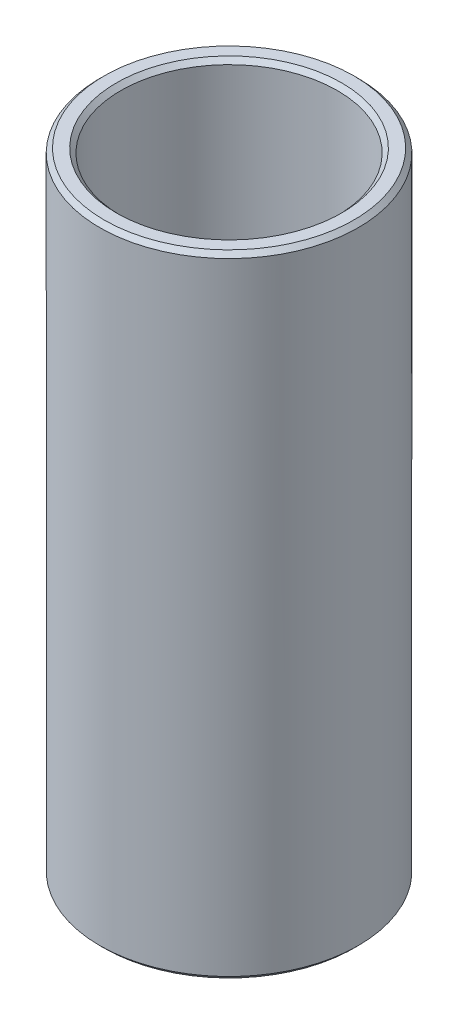
ISO-10303-21;
HEADER;
FILE_DESCRIPTION(('STEP AP214'),'2;1');
FILE_NAME('part.step','',(''),(''),'','','');
FILE_SCHEMA(('AUTOMOTIVE_DESIGN { 1 0 10303 214 1 1 1 1 }'));
ENDSEC;
DATA;
#1=APPLICATION_CONTEXT('core data for automotive mechanical design processes');
#2=APPLICATION_PROTOCOL_DEFINITION('international standard','automotive_design',2000,#1);
#3=PRODUCT_CONTEXT('',#1,'mechanical');
#4=PRODUCT('Part','Part','',(#3));
#5=PRODUCT_RELATED_PRODUCT_CATEGORY('part','',(#4));
#6=PRODUCT_DEFINITION_FORMATION('','',#4);
#7=PRODUCT_DEFINITION_CONTEXT('part definition',#1,'design');
#8=PRODUCT_DEFINITION('design','',#6,#7);
#9=PRODUCT_DEFINITION_SHAPE('','',#8);
#10=(LENGTH_UNIT() NAMED_UNIT(*) SI_UNIT(.MILLI.,.METRE.));
#11=(NAMED_UNIT(*) PLANE_ANGLE_UNIT() SI_UNIT($,.RADIAN.));
#12=(NAMED_UNIT(*) SI_UNIT($,.STERADIAN.) SOLID_ANGLE_UNIT());
#13=UNCERTAINTY_MEASURE_WITH_UNIT(LENGTH_MEASURE(1.E-05),#10,'distance_accuracy_value','');
#14=(GEOMETRIC_REPRESENTATION_CONTEXT(3) GLOBAL_UNCERTAINTY_ASSIGNED_CONTEXT((#13)) GLOBAL_UNIT_ASSIGNED_CONTEXT((#10,
#11,#12)) REPRESENTATION_CONTEXT('',''));
#15=CARTESIAN_POINT('',(0.,0.,0.));
#16=DIRECTION('',(0.,0.,1.));
#17=DIRECTION('',(1.,0.,0.));
#18=AXIS2_PLACEMENT_3D('',#15,#16,#17);
#19=CARTESIAN_POINT('',(0.,231.668085066269,0.));
#20=DIRECTION('',(0.,-1.,0.));
#21=DIRECTION('',(0.,0.,-1.));
#22=AXIS2_PLACEMENT_3D('',#19,#20,#21);
#23=CYLINDRICAL_SURFACE('',#22,47.5);
#24=CARTESIAN_POINT('',(0.,1.62430322652468,0.));
#25=DIRECTION('',(0.,1.,0.));
#26=DIRECTION('',(0.,0.,1.));
#27=AXIS2_PLACEMENT_3D('',#24,#25,#26);
#28=CIRCLE('',#27,47.5);
#29=CARTESIAN_POINT('',(0.,1.62430322652468,-47.5));
#30=VERTEX_POINT('',#29);
#31=EDGE_CURVE('E10',#30,#30,#28,.T.);
#32=CARTESIAN_POINT('',(0.,230.043781839745,0.));
#33=DIRECTION('',(0.,1.,0.));
#34=DIRECTION('',(0.,0.,1.));
#35=AXIS2_PLACEMENT_3D('',#32,#33,#34);
#36=CIRCLE('',#35,47.5);
#37=CARTESIAN_POINT('',(0.,230.043781839745,-47.5));
#38=VERTEX_POINT('',#37);
#39=EDGE_CURVE('E50',#38,#38,#36,.F.);
#40=CARTESIAN_POINT('',(0.,1.62430322652468,-47.5));
#41=CARTESIAN_POINT('',(0.,4.00367279541238,-47.5));
#42=CARTESIAN_POINT('',(0.,6.3830423643001,-47.5));
#43=CARTESIAN_POINT('',(0.,11.1417815020755,-47.5));
#44=CARTESIAN_POINT('',(0.,13.5211510709632,-47.5));
#45=CARTESIAN_POINT('',(0.,18.2798902087386,-47.5));
#46=CARTESIAN_POINT('',(0.,20.6592597776264,-47.5));
#47=CARTESIAN_POINT('',(0.,25.4179989154018,-47.5));
#48=CARTESIAN_POINT('',(0.,27.7973684842895,-47.5));
#49=CARTESIAN_POINT('',(0.,32.5561076220649,-47.5));
#50=CARTESIAN_POINT('',(0.,34.9354771909526,-47.5));
#51=CARTESIAN_POINT('',(0.,39.694216328728,-47.5));
#52=CARTESIAN_POINT('',(0.,42.0735858976158,-47.5));
#53=CARTESIAN_POINT('',(0.,46.8323250353912,-47.5));
#54=CARTESIAN_POINT('',(0.,49.2116946042789,-47.5));
#55=CARTESIAN_POINT('',(0.,53.9704337420543,-47.5));
#56=CARTESIAN_POINT('',(0.,56.349803310942,-47.5));
#57=CARTESIAN_POINT('',(0.,61.1085424487174,-47.5));
#58=CARTESIAN_POINT('',(0.,63.4879120176051,-47.5));
#59=CARTESIAN_POINT('',(0.,68.2466511553805,-47.5));
#60=CARTESIAN_POINT('',(0.,70.6260207242682,-47.5));
#61=CARTESIAN_POINT('',(0.,75.3847598620437,-47.5));
#62=CARTESIAN_POINT('',(0.,77.7641294309314,-47.5));
#63=CARTESIAN_POINT('',(0.,82.5228685687068,-47.5));
#64=CARTESIAN_POINT('',(0.,84.9022381375945,-47.5));
#65=CARTESIAN_POINT('',(0.,89.6609772753699,-47.5));
#66=CARTESIAN_POINT('',(0.,92.0403468442576,-47.5));
#67=CARTESIAN_POINT('',(0.,96.7990859820331,-47.5));
#68=CARTESIAN_POINT('',(0.,99.1784555509208,-47.5));
#69=CARTESIAN_POINT('',(0.,103.937194688696,-47.5));
#70=CARTESIAN_POINT('',(0.,106.316564257584,-47.5));
#71=CARTESIAN_POINT('',(0.,111.075303395359,-47.5));
#72=CARTESIAN_POINT('',(0.,113.454672964247,-47.5));
#73=CARTESIAN_POINT('',(0.,118.213412102022,-47.5));
#74=CARTESIAN_POINT('',(0.,120.59278167091,-47.5));
#75=CARTESIAN_POINT('',(0.,125.351520808686,-47.5));
#76=CARTESIAN_POINT('',(0.,127.730890377573,-47.5));
#77=CARTESIAN_POINT('',(0.,132.489629515349,-47.5));
#78=CARTESIAN_POINT('',(0.,134.868999084236,-47.5));
#79=CARTESIAN_POINT('',(0.,139.627738222012,-47.5));
#80=CARTESIAN_POINT('',(0.,142.0071077909,-47.5));
#81=CARTESIAN_POINT('',(0.,146.765846928675,-47.5));
#82=CARTESIAN_POINT('',(0.,149.145216497563,-47.5));
#83=CARTESIAN_POINT('',(0.,153.903955635338,-47.5));
#84=CARTESIAN_POINT('',(0.,156.283325204226,-47.5));
#85=CARTESIAN_POINT('',(0.,161.042064342001,-47.5));
#86=CARTESIAN_POINT('',(0.,163.421433910889,-47.5));
#87=CARTESIAN_POINT('',(0.,168.180173048664,-47.5));
#88=CARTESIAN_POINT('',(0.,170.559542617552,-47.5));
#89=CARTESIAN_POINT('',(0.,175.318281755327,-47.5));
#90=CARTESIAN_POINT('',(0.,177.697651324215,-47.5));
#91=CARTESIAN_POINT('',(0.,182.456390461991,-47.5));
#92=CARTESIAN_POINT('',(0.,184.835760030878,-47.5));
#93=CARTESIAN_POINT('',(0.,189.594499168654,-47.5));
#94=CARTESIAN_POINT('',(0.,191.973868737541,-47.5));
#95=CARTESIAN_POINT('',(0.,196.732607875317,-47.5));
#96=CARTESIAN_POINT('',(0.,199.111977444205,-47.5));
#97=CARTESIAN_POINT('',(0.,203.87071658198,-47.5));
#98=CARTESIAN_POINT('',(0.,206.250086150868,-47.5));
#99=CARTESIAN_POINT('',(0.,211.008825288643,-47.5));
#100=CARTESIAN_POINT('',(0.,213.388194857531,-47.5));
#101=CARTESIAN_POINT('',(0.,218.146933995306,-47.5));
#102=CARTESIAN_POINT('',(0.,220.526303564194,-47.5));
#103=CARTESIAN_POINT('',(0.,225.285042701969,-47.5));
#104=CARTESIAN_POINT('',(0.,227.664412270857,-47.5));
#105=CARTESIAN_POINT('',(0.,230.043781839745,-47.5));
#106=B_SPLINE_CURVE_WITH_KNOTS('',3,(#40,#41,#42,#43,#44,#45,#46,#47,#48,#49,#50,#51,#52,#53,
#54,#55,#56,#57,#58,#59,#60,#61,#62,#63,#64,#65,#66,#67,#68,#69,#70,#71,#72,#73,#74,#75,#76,#77,
#78,#79,#80,#81,#82,#83,#84,#85,#86,#87,#88,#89,#90,#91,#92,#93,#94,#95,#96,#97,#98,#99,#100,
#101,#102,#103,#104,#105),.UNSPECIFIED.,.F.,.F.,(4,2,2,2,2,2,2,2,2,2,2,2,2,2,2,2,2,2,2,2,2,2,2,
2,2,2,2,2,2,2,2,2,4),(0.,7.13810870666312,14.2762174133262,21.4143261199894,28.5524348266525,
35.6905435333156,42.8286522399788,49.9667609466419,57.104869653305,64.2429783599681,
71.3810870666313,78.5191957732944,85.6573044799575,92.7954131866207,99.9335218932838,
107.071630599947,114.20973930661,121.347848013273,128.485956719936,135.624065426599,
142.762174133263,149.900282839926,157.038391546589,164.176500253252,171.314608959915,
178.452717666578,185.590826373241,192.728935079904,199.867043786568,207.005152493231,
214.143261199894,221.281369906557,228.41947861322),.UNSPECIFIED.);
#107=EDGE_CURVE('BSEAM39',#30,#38,#106,.T.);
#108=ORIENTED_EDGE('',*,*,#31,.T.);
#109=ORIENTED_EDGE('',*,*,#39,.T.);
#110=ORIENTED_EDGE('',*,*,#107,.T.);
#111=ORIENTED_EDGE('',*,*,#107,.F.);
#112=EDGE_LOOP('',(#108,#110,#109,#111));
#113=FACE_BOUND('',#112,.T.);
#114=ADVANCED_FACE('F39',(#113),#23,.T.);
#115=CARTESIAN_POINT('',(0.,231.668085066269,0.));
#116=DIRECTION('',(0.,1.,0.));
#117=DIRECTION('',(0.,0.,1.));
#118=AXIS2_PLACEMENT_3D('',#115,#116,#117);
#119=PLANE('',#118);
#120=CARTESIAN_POINT('',(0.,231.668085066269,0.));
#121=DIRECTION('',(0.,1.,0.));
#122=DIRECTION('',(0.,0.,1.));
#123=AXIS2_PLACEMENT_3D('',#120,#121,#122);
#124=CIRCLE('',#123,41.4068313044736);
#125=CARTESIAN_POINT('',(0.,231.668085066269,41.4068313044736));
#126=VERTEX_POINT('',#125);
#127=EDGE_CURVE('E58',#126,#126,#124,.F.);
#128=ORIENTED_EDGE('',*,*,#127,.T.);
#129=EDGE_LOOP('',(#128));
#130=FACE_BOUND('',#129,.T.);
#131=CARTESIAN_POINT('',(0.,231.668085066269,0.));
#132=DIRECTION('',(0.,1.,0.));
#133=DIRECTION('',(0.,0.,1.));
#134=AXIS2_PLACEMENT_3D('',#131,#132,#133);
#135=CIRCLE('',#134,45.8756967734756);
#136=CARTESIAN_POINT('',(0.,231.668085066269,45.8756967734756));
#137=VERTEX_POINT('',#136);
#138=EDGE_CURVE('E61',#137,#137,#135,.T.);
#139=ORIENTED_EDGE('',*,*,#138,.T.);
#140=EDGE_LOOP('',(#139));
#141=FACE_BOUND('',#140,.T.);
#142=ADVANCED_FACE('F88',(#130,#141),#119,.T.);
#143=CARTESIAN_POINT('',(0.,0.,0.));
#144=DIRECTION('',(0.,1.,0.));
#145=DIRECTION('',(0.,0.,1.));
#146=AXIS2_PLACEMENT_3D('',#143,#144,#145);
#147=PLANE('',#146);
#148=CARTESIAN_POINT('',(0.,0.,0.));
#149=DIRECTION('',(0.,1.,0.));
#150=DIRECTION('',(0.,0.,1.));
#151=AXIS2_PLACEMENT_3D('',#148,#149,#150);
#152=CIRCLE('',#151,41.4068313044734);
#153=CARTESIAN_POINT('',(0.,0.,41.4068313044734));
#154=VERTEX_POINT('',#153);
#155=EDGE_CURVE('E51',#154,#154,#152,.T.);
#156=ORIENTED_EDGE('',*,*,#155,.T.);
#157=EDGE_LOOP('',(#156));
#158=FACE_BOUND('',#157,.T.);
#159=CARTESIAN_POINT('',(0.,0.,0.));
#160=DIRECTION('',(0.,1.,0.));
#161=DIRECTION('',(0.,0.,1.));
#162=AXIS2_PLACEMENT_3D('',#159,#160,#161);
#163=CIRCLE('',#162,45.8756967734753);
#164=CARTESIAN_POINT('',(0.,0.,45.8756967734753));
#165=VERTEX_POINT('',#164);
#166=EDGE_CURVE('E54',#165,#165,#163,.F.);
#167=ORIENTED_EDGE('',*,*,#166,.T.);
#168=EDGE_LOOP('',(#167));
#169=FACE_BOUND('',#168,.T.);
#170=ADVANCED_FACE('F83',(#158,#169),#147,.F.);
#171=CARTESIAN_POINT('',(0.,231.668085066269,0.));
#172=DIRECTION('',(0.,-1.,0.));
#173=DIRECTION('',(0.,0.,-1.));
#174=AXIS2_PLACEMENT_3D('',#171,#172,#173);
#175=CYLINDRICAL_SURFACE('',#174,39.7825280779489);
#176=CARTESIAN_POINT('',(0.,230.043781839744,0.));
#177=DIRECTION('',(0.,1.,0.));
#178=DIRECTION('',(0.,0.,1.));
#179=AXIS2_PLACEMENT_3D('',#176,#177,#178);
#180=CIRCLE('',#179,39.7825280779489);
#181=CARTESIAN_POINT('',(0.,230.043781839744,-39.7825280779489));
#182=VERTEX_POINT('',#181);
#183=EDGE_CURVE('E67',#182,#182,#180,.T.);
#184=CARTESIAN_POINT('',(0.,1.62430322652449,0.));
#185=DIRECTION('',(0.,1.,0.));
#186=DIRECTION('',(0.,0.,1.));
#187=AXIS2_PLACEMENT_3D('',#184,#185,#186);
#188=CIRCLE('',#187,39.7825280779489);
#189=CARTESIAN_POINT('',(0.,1.62430322652446,-39.7825280779489));
#190=VERTEX_POINT('',#189);
#191=EDGE_CURVE('E69',#190,#190,#188,.F.);
#192=CARTESIAN_POINT('',(0.,230.043781839744,-39.7825280779489));
#193=CARTESIAN_POINT('',(0.,227.664412270857,-39.7825280779489));
#194=CARTESIAN_POINT('',(0.,225.285042701969,-39.7825280779489));
#195=CARTESIAN_POINT('',(0.,220.526303564194,-39.7825280779489));
#196=CARTESIAN_POINT('',(0.,218.146933995306,-39.7825280779489));
#197=CARTESIAN_POINT('',(0.,213.38819485753,-39.7825280779489));
#198=CARTESIAN_POINT('',(0.,211.008825288643,-39.7825280779489));
#199=CARTESIAN_POINT('',(0.,206.250086150867,-39.7825280779489));
#200=CARTESIAN_POINT('',(0.,203.87071658198,-39.7825280779489));
#201=CARTESIAN_POINT('',(0.,199.111977444204,-39.7825280779489));
#202=CARTESIAN_POINT('',(0.,196.732607875317,-39.7825280779489));
#203=CARTESIAN_POINT('',(0.,191.973868737541,-39.7825280779489));
#204=CARTESIAN_POINT('',(0.,189.594499168653,-39.7825280779489));
#205=CARTESIAN_POINT('',(0.,184.835760030878,-39.7825280779489));
#206=CARTESIAN_POINT('',(0.,182.45639046199,-39.7825280779489));
#207=CARTESIAN_POINT('',(0.,177.697651324215,-39.7825280779489));
#208=CARTESIAN_POINT('',(0.,175.318281755327,-39.7825280779489));
#209=CARTESIAN_POINT('',(0.,170.559542617552,-39.7825280779489));
#210=CARTESIAN_POINT('',(0.,168.180173048664,-39.7825280779489));
#211=CARTESIAN_POINT('',(0.,163.421433910889,-39.7825280779489));
#212=CARTESIAN_POINT('',(0.,161.042064342001,-39.7825280779489));
#213=CARTESIAN_POINT('',(0.,156.283325204225,-39.7825280779489));
#214=CARTESIAN_POINT('',(0.,153.903955635338,-39.7825280779489));
#215=CARTESIAN_POINT('',(0.,149.145216497562,-39.7825280779489));
#216=CARTESIAN_POINT('',(0.,146.765846928675,-39.7825280779489));
#217=CARTESIAN_POINT('',(0.,142.007107790899,-39.7825280779489));
#218=CARTESIAN_POINT('',(0.,139.627738222012,-39.7825280779489));
#219=CARTESIAN_POINT('',(0.,134.868999084236,-39.7825280779489));
#220=CARTESIAN_POINT('',(0.,132.489629515348,-39.7825280779489));
#221=CARTESIAN_POINT('',(0.,127.730890377573,-39.7825280779489));
#222=CARTESIAN_POINT('',(0.,125.351520808685,-39.7825280779489));
#223=CARTESIAN_POINT('',(0.,120.59278167091,-39.7825280779489));
#224=CARTESIAN_POINT('',(0.,118.213412102022,-39.7825280779489));
#225=CARTESIAN_POINT('',(0.,113.454672964247,-39.7825280779489));
#226=CARTESIAN_POINT('',(0.,111.075303395359,-39.7825280779489));
#227=CARTESIAN_POINT('',(0.,106.316564257584,-39.7825280779489));
#228=CARTESIAN_POINT('',(0.,103.937194688696,-39.7825280779489));
#229=CARTESIAN_POINT('',(0.,99.1784555509205,-39.7825280779489));
#230=CARTESIAN_POINT('',(0.,96.7990859820328,-39.7825280779489));
#231=CARTESIAN_POINT('',(0.,92.0403468442574,-39.7825280779489));
#232=CARTESIAN_POINT('',(0.,89.6609772753697,-39.7825280779489));
#233=CARTESIAN_POINT('',(0.,84.9022381375943,-39.7825280779489));
#234=CARTESIAN_POINT('',(0.,82.5228685687065,-39.7825280779489));
#235=CARTESIAN_POINT('',(0.,77.7641294309311,-39.7825280779489));
#236=CARTESIAN_POINT('',(0.,75.3847598620434,-39.7825280779489));
#237=CARTESIAN_POINT('',(0.,70.626020724268,-39.7825280779489));
#238=CARTESIAN_POINT('',(0.,68.2466511553803,-39.7825280779489));
#239=CARTESIAN_POINT('',(0.,63.4879120176049,-39.7825280779489));
#240=CARTESIAN_POINT('',(0.,61.1085424487172,-39.7825280779489));
#241=CARTESIAN_POINT('',(0.,56.3498033109418,-39.7825280779489));
#242=CARTESIAN_POINT('',(0.,53.970433742054,-39.7825280779489));
#243=CARTESIAN_POINT('',(0.,49.2116946042786,-39.7825280779489));
#244=CARTESIAN_POINT('',(0.,46.8323250353909,-39.7825280779489));
#245=CARTESIAN_POINT('',(0.,42.0735858976155,-39.7825280779489));
#246=CARTESIAN_POINT('',(0.,39.6942163287278,-39.7825280779489));
#247=CARTESIAN_POINT('',(0.,34.9354771909524,-39.7825280779489));
#248=CARTESIAN_POINT('',(0.,32.5561076220647,-39.7825280779489));
#249=CARTESIAN_POINT('',(0.,27.7973684842892,-39.7825280779489));
#250=CARTESIAN_POINT('',(0.,25.4179989154015,-39.7825280779489));
#251=CARTESIAN_POINT('',(0.,20.6592597776261,-39.7825280779489));
#252=CARTESIAN_POINT('',(0.,18.2798902087384,-39.7825280779489));
#253=CARTESIAN_POINT('',(0.,13.521151070963,-39.7825280779489));
#254=CARTESIAN_POINT('',(0.,11.1417815020753,-39.7825280779489));
#255=CARTESIAN_POINT('',(0.,6.38304236429985,-39.7825280779489));
#256=CARTESIAN_POINT('',(0.,4.00367279541216,-39.7825280779489));
#257=CARTESIAN_POINT('',(0.,1.62430322652446,-39.7825280779489));
#258=B_SPLINE_CURVE_WITH_KNOTS('',3,(#192,#193,#194,#195,#196,#197,#198,#199,#200,#201,#202,
#203,#204,#205,#206,#207,#208,#209,#210,#211,#212,#213,#214,#215,#216,#217,#218,#219,#220,#221,
#222,#223,#224,#225,#226,#227,#228,#229,#230,#231,#232,#233,#234,#235,#236,#237,#238,#239,#240,
#241,#242,#243,#244,#245,#246,#247,#248,#249,#250,#251,#252,#253,#254,#255,#256,#257),
.UNSPECIFIED.,.F.,.F.,(4,2,2,2,2,2,2,2,2,2,2,2,2,2,2,2,2,2,2,2,2,2,2,2,2,2,2,2,2,2,2,2,4),(0.,
7.13810870666315,14.2762174133263,21.4143261199894,28.5524348266525,35.6905435333156,
42.8286522399788,49.9667609466419,57.104869653305,64.2429783599681,71.3810870666313,
78.5191957732944,85.6573044799575,92.7954131866206,99.9335218932838,107.071630599947,
114.20973930661,121.347848013273,128.485956719936,135.624065426599,142.762174133263,
149.900282839926,157.038391546589,164.176500253252,171.314608959915,178.452717666578,
185.590826373241,192.728935079904,199.867043786568,207.005152493231,214.143261199894,
221.281369906557,228.41947861322),.UNSPECIFIED.);
#259=EDGE_CURVE('BSEAM71',#182,#190,#258,.T.);
#260=ORIENTED_EDGE('',*,*,#183,.T.);
#261=ORIENTED_EDGE('',*,*,#191,.T.);
#262=ORIENTED_EDGE('',*,*,#259,.T.);
#263=ORIENTED_EDGE('',*,*,#259,.F.);
#264=EDGE_LOOP('',(#260,#262,#261,#263));
#265=FACE_BOUND('',#264,.T.);
#266=ADVANCED_FACE('F71',(#265),#175,.F.);
#267=CARTESIAN_POINT('',(0.,230.043781839744,0.));
#268=DIRECTION('',(0.,1.,0.));
#269=DIRECTION('',(0.,0.,1.));
#270=AXIS2_PLACEMENT_3D('',#267,#268,#269);
#271=CONICAL_SURFACE('',#270,39.7825280779489,0.785398163397453);
#272=ORIENTED_EDGE('',*,*,#127,.F.);
#273=EDGE_LOOP('',(#272));
#274=FACE_BOUND('',#273,.T.);
#275=ORIENTED_EDGE('',*,*,#183,.F.);
#276=EDGE_LOOP('',(#275));
#277=FACE_BOUND('',#276,.T.);
#278=ADVANCED_FACE('F77',(#274,#277),#271,.F.);
#279=CARTESIAN_POINT('',(0.,0.,0.));
#280=DIRECTION('',(0.,-1.,0.));
#281=DIRECTION('',(0.,0.,-1.));
#282=AXIS2_PLACEMENT_3D('',#279,#280,#281);
#283=CONICAL_SURFACE('',#282,41.4068313044734,0.785398163397452);
#284=ORIENTED_EDGE('',*,*,#191,.F.);
#285=EDGE_LOOP('',(#284));
#286=FACE_BOUND('',#285,.T.);
#287=ORIENTED_EDGE('',*,*,#155,.F.);
#288=EDGE_LOOP('',(#287));
#289=FACE_BOUND('',#288,.T.);
#290=ADVANCED_FACE('F73',(#286,#289),#283,.F.);
#291=CARTESIAN_POINT('',(0.,1.62430322652468,0.));
#292=DIRECTION('',(0.,1.,0.));
#293=DIRECTION('',(0.,0.,1.));
#294=AXIS2_PLACEMENT_3D('',#291,#292,#293);
#295=CONICAL_SURFACE('',#294,47.5,0.785398163397459);
#296=ORIENTED_EDGE('',*,*,#166,.F.);
#297=EDGE_LOOP('',(#296));
#298=FACE_BOUND('',#297,.T.);
#299=ORIENTED_EDGE('',*,*,#31,.F.);
#300=EDGE_LOOP('',(#299));
#301=FACE_BOUND('',#300,.T.);
#302=ADVANCED_FACE('F76',(#298,#301),#295,.T.);
#303=CARTESIAN_POINT('',(0.,231.668085066269,0.));
#304=DIRECTION('',(0.,-1.,0.));
#305=DIRECTION('',(0.,0.,-1.));
#306=AXIS2_PLACEMENT_3D('',#303,#304,#305);
#307=CONICAL_SURFACE('',#306,45.8756967734756,0.785398163397448);
#308=ORIENTED_EDGE('',*,*,#39,.F.);
#309=EDGE_LOOP('',(#308));
#310=FACE_BOUND('',#309,.T.);
#311=ORIENTED_EDGE('',*,*,#138,.F.);
#312=EDGE_LOOP('',(#311));
#313=FACE_BOUND('',#312,.T.);
#314=ADVANCED_FACE('F45',(#310,#313),#307,.T.);
#315=CLOSED_SHELL('',(#114,#142,#170,#266,#278,#290,#302,#314));
#316=MANIFOLD_SOLID_BREP('B2',#315);
#317=ADVANCED_BREP_SHAPE_REPRESENTATION('',(#18,#316),#14);
#318=SHAPE_DEFINITION_REPRESENTATION(#9,#317);
ENDSEC;
END-ISO-10303-21;
